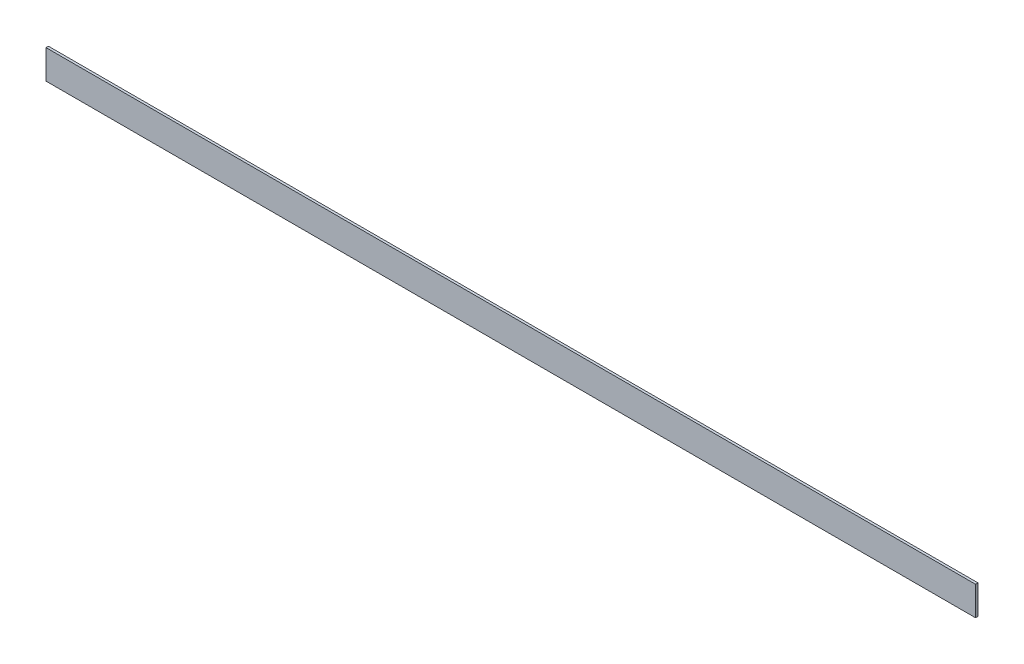
ISO-10303-21;
HEADER;
FILE_DESCRIPTION(('STEP AP214'),'2;1');
FILE_NAME('part.step','',(''),(''),'','','');
FILE_SCHEMA(('AUTOMOTIVE_DESIGN { 1 0 10303 214 1 1 1 1 }'));
ENDSEC;
DATA;
#1=APPLICATION_CONTEXT('core data for automotive mechanical design processes');
#2=APPLICATION_PROTOCOL_DEFINITION('international standard','automotive_design',2000,#1);
#3=PRODUCT_CONTEXT('',#1,'mechanical');
#4=PRODUCT('Part','Part','',(#3));
#5=PRODUCT_RELATED_PRODUCT_CATEGORY('part','',(#4));
#6=PRODUCT_DEFINITION_FORMATION('','',#4);
#7=PRODUCT_DEFINITION_CONTEXT('part definition',#1,'design');
#8=PRODUCT_DEFINITION('design','',#6,#7);
#9=PRODUCT_DEFINITION_SHAPE('','',#8);
#10=(LENGTH_UNIT() NAMED_UNIT(*) SI_UNIT(.MILLI.,.METRE.));
#11=(NAMED_UNIT(*) PLANE_ANGLE_UNIT() SI_UNIT($,.RADIAN.));
#12=(NAMED_UNIT(*) SI_UNIT($,.STERADIAN.) SOLID_ANGLE_UNIT());
#13=UNCERTAINTY_MEASURE_WITH_UNIT(LENGTH_MEASURE(1.E-05),#10,'distance_accuracy_value','');
#14=(GEOMETRIC_REPRESENTATION_CONTEXT(3) GLOBAL_UNCERTAINTY_ASSIGNED_CONTEXT((#13)) GLOBAL_UNIT_ASSIGNED_CONTEXT((#10,
#11,#12)) REPRESENTATION_CONTEXT('',''));
#15=CARTESIAN_POINT('',(0.,0.,0.));
#16=DIRECTION('',(0.,0.,1.));
#17=DIRECTION('',(1.,0.,0.));
#18=AXIS2_PLACEMENT_3D('',#15,#16,#17);
#19=CARTESIAN_POINT('',(2438.4,-38.1,-3.175));
#20=DIRECTION('',(0.,0.,1.));
#21=DIRECTION('',(1.,0.,0.));
#22=AXIS2_PLACEMENT_3D('',#19,#20,#21);
#23=PLANE('',#22);
#24=DIRECTION('',(0.,1.,0.));
#25=VECTOR('',#24,1.);
#26=CARTESIAN_POINT('',(0.,-38.1,-3.175));
#27=LINE('',#26,#25);
#28=CARTESIAN_POINT('',(0.,-38.1,-3.175));
#29=VERTEX_POINT('',#28);
#30=CARTESIAN_POINT('',(0.,38.1,-3.175));
#31=VERTEX_POINT('',#30);
#32=EDGE_CURVE('E98',#29,#31,#27,.T.);
#33=ORIENTED_EDGE('',*,*,#32,.T.);
#34=DIRECTION('',(-1.,0.,0.));
#35=VECTOR('',#34,1.);
#36=CARTESIAN_POINT('',(2438.4,38.1,-3.175));
#37=LINE('',#36,#35);
#38=CARTESIAN_POINT('',(2438.4,38.1,-3.175));
#39=VERTEX_POINT('',#38);
#40=EDGE_CURVE('E11',#39,#31,#37,.T.);
#41=ORIENTED_EDGE('',*,*,#40,.F.);
#42=DIRECTION('',(0.,1.,0.));
#43=VECTOR('',#42,1.);
#44=CARTESIAN_POINT('',(2438.4,-38.1,-3.175));
#45=LINE('',#44,#43);
#46=CARTESIAN_POINT('',(2438.4,-38.1,-3.175));
#47=VERTEX_POINT('',#46);
#48=EDGE_CURVE('E86',#47,#39,#45,.T.);
#49=ORIENTED_EDGE('',*,*,#48,.F.);
#50=DIRECTION('',(-1.,0.,0.));
#51=VECTOR('',#50,1.);
#52=CARTESIAN_POINT('',(2438.4,-38.1,-3.175));
#53=LINE('',#52,#51);
#54=EDGE_CURVE('E94',#47,#29,#53,.T.);
#55=ORIENTED_EDGE('',*,*,#54,.T.);
#56=EDGE_LOOP('',(#33,#41,#49,#55));
#57=FACE_BOUND('',#56,.T.);
#58=ADVANCED_FACE('F35',(#57),#23,.F.);
#59=CARTESIAN_POINT('',(2438.4,38.1,3.175));
#60=DIRECTION('',(0.,-1.,0.));
#61=DIRECTION('',(0.,0.,-1.));
#62=AXIS2_PLACEMENT_3D('',#59,#60,#61);
#63=PLANE('',#62);
#64=DIRECTION('',(0.,0.,1.));
#65=VECTOR('',#64,1.);
#66=CARTESIAN_POINT('',(0.,38.1,3.175));
#67=LINE('',#66,#65);
#68=CARTESIAN_POINT('',(0.,38.1,3.175));
#69=VERTEX_POINT('',#68);
#70=EDGE_CURVE('E90',#31,#69,#67,.T.);
#71=ORIENTED_EDGE('',*,*,#70,.T.);
#72=DIRECTION('',(-1.,0.,0.));
#73=VECTOR('',#72,1.);
#74=CARTESIAN_POINT('',(2438.4,38.1,3.175));
#75=LINE('',#74,#73);
#76=CARTESIAN_POINT('',(2438.4,38.1,3.175));
#77=VERTEX_POINT('',#76);
#78=EDGE_CURVE('E43',#77,#69,#75,.T.);
#79=ORIENTED_EDGE('',*,*,#78,.F.);
#80=DIRECTION('',(0.,0.,1.));
#81=VECTOR('',#80,1.);
#82=CARTESIAN_POINT('',(2438.4,38.1,3.175));
#83=LINE('',#82,#81);
#84=EDGE_CURVE('E81',#39,#77,#83,.T.);
#85=ORIENTED_EDGE('',*,*,#84,.F.);
#86=ORIENTED_EDGE('',*,*,#40,.T.);
#87=EDGE_LOOP('',(#71,#79,#85,#86));
#88=FACE_BOUND('',#87,.T.);
#89=ADVANCED_FACE('F89',(#88),#63,.F.);
#90=CARTESIAN_POINT('',(2438.4,-38.1,3.175));
#91=DIRECTION('',(0.,0.,-1.));
#92=DIRECTION('',(-1.,0.,0.));
#93=AXIS2_PLACEMENT_3D('',#90,#91,#92);
#94=PLANE('',#93);
#95=DIRECTION('',(0.,-1.,0.));
#96=VECTOR('',#95,1.);
#97=CARTESIAN_POINT('',(0.,-38.1,3.175));
#98=LINE('',#97,#96);
#99=CARTESIAN_POINT('',(0.,-38.1,3.175));
#100=VERTEX_POINT('',#99);
#101=EDGE_CURVE('E68',#69,#100,#98,.T.);
#102=ORIENTED_EDGE('',*,*,#101,.T.);
#103=DIRECTION('',(-1.,0.,0.));
#104=VECTOR('',#103,1.);
#105=CARTESIAN_POINT('',(2438.4,-38.1,3.175));
#106=LINE('',#105,#104);
#107=CARTESIAN_POINT('',(2438.4,-38.1,3.175));
#108=VERTEX_POINT('',#107);
#109=EDGE_CURVE('E91',#108,#100,#106,.T.);
#110=ORIENTED_EDGE('',*,*,#109,.F.);
#111=DIRECTION('',(0.,-1.,0.));
#112=VECTOR('',#111,1.);
#113=CARTESIAN_POINT('',(2438.4,-38.1,3.175));
#114=LINE('',#113,#112);
#115=EDGE_CURVE('E84',#77,#108,#114,.T.);
#116=ORIENTED_EDGE('',*,*,#115,.F.);
#117=ORIENTED_EDGE('',*,*,#78,.T.);
#118=EDGE_LOOP('',(#102,#110,#116,#117));
#119=FACE_BOUND('',#118,.T.);
#120=ADVANCED_FACE('F92',(#119),#94,.F.);
#121=CARTESIAN_POINT('',(2438.4,-38.1,3.175));
#122=DIRECTION('',(0.,1.,0.));
#123=DIRECTION('',(0.,0.,1.));
#124=AXIS2_PLACEMENT_3D('',#121,#122,#123);
#125=PLANE('',#124);
#126=DIRECTION('',(0.,0.,-1.));
#127=VECTOR('',#126,1.);
#128=CARTESIAN_POINT('',(0.,-38.1,3.175));
#129=LINE('',#128,#127);
#130=EDGE_CURVE('E74',#100,#29,#129,.T.);
#131=ORIENTED_EDGE('',*,*,#130,.T.);
#132=ORIENTED_EDGE('',*,*,#54,.F.);
#133=DIRECTION('',(0.,0.,-1.));
#134=VECTOR('',#133,1.);
#135=CARTESIAN_POINT('',(2438.4,-38.1,3.175));
#136=LINE('',#135,#134);
#137=EDGE_CURVE('E51',#108,#47,#136,.T.);
#138=ORIENTED_EDGE('',*,*,#137,.F.);
#139=ORIENTED_EDGE('',*,*,#109,.T.);
#140=EDGE_LOOP('',(#131,#132,#138,#139));
#141=FACE_BOUND('',#140,.T.);
#142=ADVANCED_FACE('F105',(#141),#125,.F.);
#143=CARTESIAN_POINT('',(2438.4,0.,0.));
#144=DIRECTION('',(-1.,0.,0.));
#145=DIRECTION('',(0.,0.,1.));
#146=AXIS2_PLACEMENT_3D('',#143,#144,#145);
#147=PLANE('',#146);
#148=ORIENTED_EDGE('',*,*,#48,.T.);
#149=ORIENTED_EDGE('',*,*,#84,.T.);
#150=ORIENTED_EDGE('',*,*,#115,.T.);
#151=ORIENTED_EDGE('',*,*,#137,.T.);
#152=EDGE_LOOP('',(#148,#149,#150,#151));
#153=FACE_BOUND('',#152,.T.);
#154=ADVANCED_FACE('F82',(#153),#147,.F.);
#155=CARTESIAN_POINT('',(0.,0.,0.));
#156=DIRECTION('',(-1.,0.,0.));
#157=DIRECTION('',(0.,0.,1.));
#158=AXIS2_PLACEMENT_3D('',#155,#156,#157);
#159=PLANE('',#158);
#160=ORIENTED_EDGE('',*,*,#32,.F.);
#161=ORIENTED_EDGE('',*,*,#130,.F.);
#162=ORIENTED_EDGE('',*,*,#101,.F.);
#163=ORIENTED_EDGE('',*,*,#70,.F.);
#164=EDGE_LOOP('',(#160,#161,#162,#163));
#165=FACE_BOUND('',#164,.T.);
#166=ADVANCED_FACE('F108',(#165),#159,.T.);
#167=CLOSED_SHELL('',(#58,#89,#120,#142,#154,#166));
#168=MANIFOLD_SOLID_BREP('B2',#167);
#169=ADVANCED_BREP_SHAPE_REPRESENTATION('',(#18,#168),#14);
#170=SHAPE_DEFINITION_REPRESENTATION(#9,#169);
ENDSEC;
END-ISO-10303-21;
